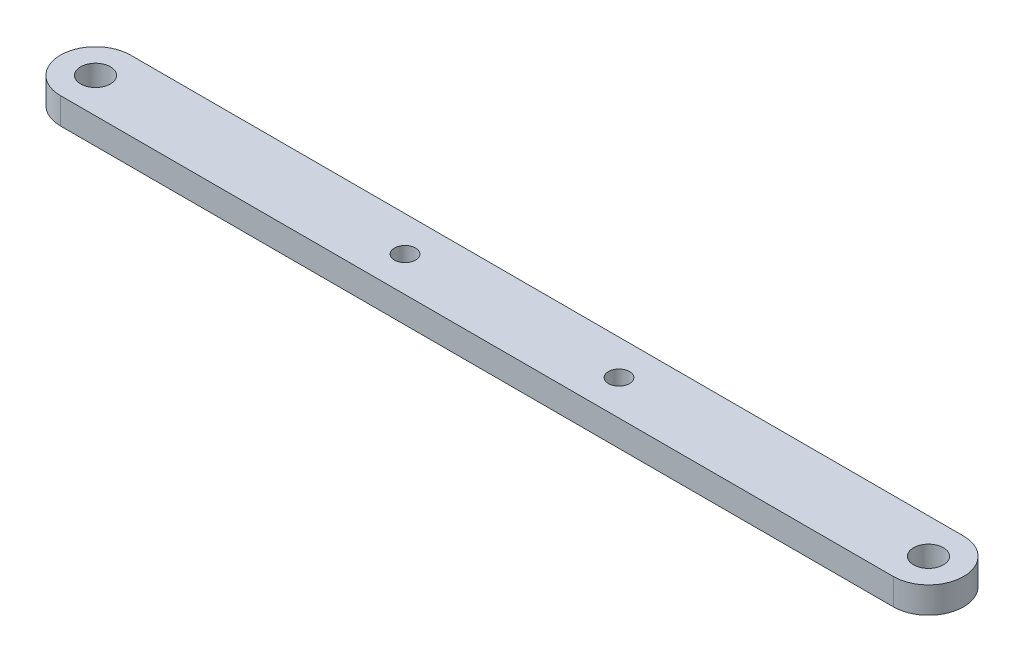
ISO-10303-21;
HEADER;
FILE_DESCRIPTION(('STEP AP214'),'2;1');
FILE_NAME('part.step','',(''),(''),'','','');
FILE_SCHEMA(('AUTOMOTIVE_DESIGN { 1 0 10303 214 1 1 1 1 }'));
ENDSEC;
DATA;
#1=APPLICATION_CONTEXT('core data for automotive mechanical design processes');
#2=APPLICATION_PROTOCOL_DEFINITION('international standard','automotive_design',2000,#1);
#3=PRODUCT_CONTEXT('',#1,'mechanical');
#4=PRODUCT('Part','Part','',(#3));
#5=PRODUCT_RELATED_PRODUCT_CATEGORY('part','',(#4));
#6=PRODUCT_DEFINITION_FORMATION('','',#4);
#7=PRODUCT_DEFINITION_CONTEXT('part definition',#1,'design');
#8=PRODUCT_DEFINITION('design','',#6,#7);
#9=PRODUCT_DEFINITION_SHAPE('','',#8);
#10=(LENGTH_UNIT() NAMED_UNIT(*) SI_UNIT(.MILLI.,.METRE.));
#11=(NAMED_UNIT(*) PLANE_ANGLE_UNIT() SI_UNIT($,.RADIAN.));
#12=(NAMED_UNIT(*) SI_UNIT($,.STERADIAN.) SOLID_ANGLE_UNIT());
#13=UNCERTAINTY_MEASURE_WITH_UNIT(LENGTH_MEASURE(1.E-05),#10,'distance_accuracy_value','');
#14=(GEOMETRIC_REPRESENTATION_CONTEXT(3) GLOBAL_UNCERTAINTY_ASSIGNED_CONTEXT((#13)) GLOBAL_UNIT_ASSIGNED_CONTEXT((#10,
#11,#12)) REPRESENTATION_CONTEXT('',''));
#15=CARTESIAN_POINT('',(0.,0.,0.));
#16=DIRECTION('',(0.,0.,1.));
#17=DIRECTION('',(1.,0.,0.));
#18=AXIS2_PLACEMENT_3D('',#15,#16,#17);
#19=CARTESIAN_POINT('',(0.,3.,0.));
#20=DIRECTION('',(0.,-1.,0.));
#21=DIRECTION('',(0.,0.,-1.));
#22=AXIS2_PLACEMENT_3D('',#19,#20,#21);
#23=CYLINDRICAL_SURFACE('',#22,4.);
#24=CARTESIAN_POINT('',(0.,0.,0.));
#25=DIRECTION('',(0.,1.,0.));
#26=DIRECTION('',(0.,0.,1.));
#27=AXIS2_PLACEMENT_3D('',#24,#25,#26);
#28=CIRCLE('',#27,4.);
#29=CARTESIAN_POINT('',(0.,0.,-4.));
#30=VERTEX_POINT('',#29);
#31=CARTESIAN_POINT('',(0.,0.,4.));
#32=VERTEX_POINT('',#31);
#33=EDGE_CURVE('E96',#30,#32,#28,.T.);
#34=ORIENTED_EDGE('',*,*,#33,.T.);
#35=DIRECTION('',(0.,-1.,0.));
#36=VECTOR('',#35,1.);
#37=CARTESIAN_POINT('',(0.,3.,4.));
#38=LINE('',#37,#36);
#39=CARTESIAN_POINT('',(0.,3.,4.));
#40=VERTEX_POINT('',#39);
#41=EDGE_CURVE('E11',#40,#32,#38,.T.);
#42=ORIENTED_EDGE('',*,*,#41,.F.);
#43=CARTESIAN_POINT('',(0.,3.,0.));
#44=DIRECTION('',(0.,1.,0.));
#45=DIRECTION('',(0.,0.,1.));
#46=AXIS2_PLACEMENT_3D('',#43,#44,#45);
#47=CIRCLE('',#46,4.);
#48=CARTESIAN_POINT('',(0.,3.,-4.));
#49=VERTEX_POINT('',#48);
#50=EDGE_CURVE('E84',#49,#40,#47,.T.);
#51=ORIENTED_EDGE('',*,*,#50,.F.);
#52=DIRECTION('',(0.,-1.,0.));
#53=VECTOR('',#52,1.);
#54=CARTESIAN_POINT('',(0.,3.,-4.));
#55=LINE('',#54,#53);
#56=EDGE_CURVE('E92',#49,#30,#55,.T.);
#57=ORIENTED_EDGE('',*,*,#56,.T.);
#58=EDGE_LOOP('',(#34,#42,#51,#57));
#59=FACE_BOUND('',#58,.T.);
#60=ADVANCED_FACE('F33',(#59),#23,.T.);
#61=CARTESIAN_POINT('',(0.,3.,4.));
#62=DIRECTION('',(0.,0.,-1.));
#63=DIRECTION('',(-1.,0.,0.));
#64=AXIS2_PLACEMENT_3D('',#61,#62,#63);
#65=PLANE('',#64);
#66=DIRECTION('',(1.,0.,0.));
#67=VECTOR('',#66,1.);
#68=CARTESIAN_POINT('',(0.,0.,4.));
#69=LINE('',#68,#67);
#70=CARTESIAN_POINT('',(95.,0.,4.));
#71=VERTEX_POINT('',#70);
#72=EDGE_CURVE('E88',#32,#71,#69,.T.);
#73=ORIENTED_EDGE('',*,*,#72,.T.);
#74=DIRECTION('',(0.,-1.,0.));
#75=VECTOR('',#74,1.);
#76=CARTESIAN_POINT('',(95.,3.,4.));
#77=LINE('',#76,#75);
#78=CARTESIAN_POINT('',(95.,3.,4.));
#79=VERTEX_POINT('',#78);
#80=EDGE_CURVE('E41',#79,#71,#77,.T.);
#81=ORIENTED_EDGE('',*,*,#80,.F.);
#82=DIRECTION('',(1.,0.,0.));
#83=VECTOR('',#82,1.);
#84=CARTESIAN_POINT('',(0.,3.,4.));
#85=LINE('',#84,#83);
#86=EDGE_CURVE('E79',#40,#79,#85,.T.);
#87=ORIENTED_EDGE('',*,*,#86,.F.);
#88=ORIENTED_EDGE('',*,*,#41,.T.);
#89=EDGE_LOOP('',(#73,#81,#87,#88));
#90=FACE_BOUND('',#89,.T.);
#91=ADVANCED_FACE('F87',(#90),#65,.F.);
#92=CARTESIAN_POINT('',(95.,3.,0.));
#93=DIRECTION('',(0.,-1.,0.));
#94=DIRECTION('',(0.,0.,-1.));
#95=AXIS2_PLACEMENT_3D('',#92,#93,#94);
#96=CYLINDRICAL_SURFACE('',#95,4.);
#97=CARTESIAN_POINT('',(95.,0.,0.));
#98=DIRECTION('',(0.,1.,0.));
#99=DIRECTION('',(0.,0.,1.));
#100=AXIS2_PLACEMENT_3D('',#97,#98,#99);
#101=CIRCLE('',#100,4.);
#102=CARTESIAN_POINT('',(95.,0.,-4.));
#103=VERTEX_POINT('',#102);
#104=EDGE_CURVE('E66',#71,#103,#101,.T.);
#105=ORIENTED_EDGE('',*,*,#104,.T.);
#106=DIRECTION('',(0.,-1.,0.));
#107=VECTOR('',#106,1.);
#108=CARTESIAN_POINT('',(95.,3.,-4.));
#109=LINE('',#108,#107);
#110=CARTESIAN_POINT('',(95.,3.,-4.));
#111=VERTEX_POINT('',#110);
#112=EDGE_CURVE('E89',#111,#103,#109,.T.);
#113=ORIENTED_EDGE('',*,*,#112,.F.);
#114=CARTESIAN_POINT('',(95.,3.,0.));
#115=DIRECTION('',(0.,1.,0.));
#116=DIRECTION('',(0.,0.,1.));
#117=AXIS2_PLACEMENT_3D('',#114,#115,#116);
#118=CIRCLE('',#117,4.);
#119=EDGE_CURVE('E82',#79,#111,#118,.T.);
#120=ORIENTED_EDGE('',*,*,#119,.F.);
#121=ORIENTED_EDGE('',*,*,#80,.T.);
#122=EDGE_LOOP('',(#105,#113,#120,#121));
#123=FACE_BOUND('',#122,.T.);
#124=ADVANCED_FACE('F90',(#123),#96,.T.);
#125=CARTESIAN_POINT('',(0.,3.,-4.));
#126=DIRECTION('',(0.,0.,1.));
#127=DIRECTION('',(1.,0.,0.));
#128=AXIS2_PLACEMENT_3D('',#125,#126,#127);
#129=PLANE('',#128);
#130=DIRECTION('',(-1.,0.,0.));
#131=VECTOR('',#130,1.);
#132=CARTESIAN_POINT('',(0.,0.,-4.));
#133=LINE('',#132,#131);
#134=EDGE_CURVE('E72',#103,#30,#133,.T.);
#135=ORIENTED_EDGE('',*,*,#134,.T.);
#136=ORIENTED_EDGE('',*,*,#56,.F.);
#137=DIRECTION('',(-1.,0.,0.));
#138=VECTOR('',#137,1.);
#139=CARTESIAN_POINT('',(0.,3.,-4.));
#140=LINE('',#139,#138);
#141=EDGE_CURVE('E49',#111,#49,#140,.T.);
#142=ORIENTED_EDGE('',*,*,#141,.F.);
#143=ORIENTED_EDGE('',*,*,#112,.T.);
#144=EDGE_LOOP('',(#135,#136,#142,#143));
#145=FACE_BOUND('',#144,.T.);
#146=ADVANCED_FACE('F104',(#145),#129,.F.);
#147=CARTESIAN_POINT('',(0.,3.,0.));
#148=DIRECTION('',(0.,1.,0.));
#149=DIRECTION('',(0.,0.,1.));
#150=AXIS2_PLACEMENT_3D('',#147,#148,#149);
#151=PLANE('',#150);
#152=CARTESIAN_POINT('',(59.7,3.,0.));
#153=DIRECTION('',(0.,1.,0.));
#154=DIRECTION('',(0.,0.,1.));
#155=AXIS2_PLACEMENT_3D('',#152,#153,#154);
#156=CIRCLE('',#155,1.19999999999999);
#157=CARTESIAN_POINT('',(59.7,3.,1.19999999999999));
#158=VERTEX_POINT('',#157);
#159=EDGE_CURVE('E130',#158,#158,#156,.T.);
#160=ORIENTED_EDGE('',*,*,#159,.F.);
#161=EDGE_LOOP('',(#160));
#162=FACE_BOUND('',#161,.T.);
#163=CARTESIAN_POINT('',(35.3,3.,0.));
#164=DIRECTION('',(0.,1.,0.));
#165=DIRECTION('',(0.,0.,1.));
#166=AXIS2_PLACEMENT_3D('',#163,#164,#165);
#167=CIRCLE('',#166,1.19999999999999);
#168=CARTESIAN_POINT('',(35.3,3.,1.19999999999999));
#169=VERTEX_POINT('',#168);
#170=EDGE_CURVE('E124',#169,#169,#167,.T.);
#171=ORIENTED_EDGE('',*,*,#170,.F.);
#172=EDGE_LOOP('',(#171));
#173=FACE_BOUND('',#172,.T.);
#174=CARTESIAN_POINT('',(95.,3.,0.));
#175=DIRECTION('',(0.,1.,0.));
#176=DIRECTION('',(0.,0.,1.));
#177=AXIS2_PLACEMENT_3D('',#174,#175,#176);
#178=CIRCLE('',#177,1.69999999999999);
#179=CARTESIAN_POINT('',(95.,3.,1.69999999999999));
#180=VERTEX_POINT('',#179);
#181=EDGE_CURVE('E118',#180,#180,#178,.T.);
#182=ORIENTED_EDGE('',*,*,#181,.F.);
#183=EDGE_LOOP('',(#182));
#184=FACE_BOUND('',#183,.T.);
#185=CARTESIAN_POINT('',(0.,3.,0.));
#186=DIRECTION('',(0.,1.,0.));
#187=DIRECTION('',(0.,0.,1.));
#188=AXIS2_PLACEMENT_3D('',#185,#186,#187);
#189=CIRCLE('',#188,1.69999999999999);
#190=CARTESIAN_POINT('',(0.,3.,1.69999999999999));
#191=VERTEX_POINT('',#190);
#192=EDGE_CURVE('E112',#191,#191,#189,.T.);
#193=ORIENTED_EDGE('',*,*,#192,.F.);
#194=EDGE_LOOP('',(#193));
#195=FACE_BOUND('',#194,.T.);
#196=ORIENTED_EDGE('',*,*,#50,.T.);
#197=ORIENTED_EDGE('',*,*,#86,.T.);
#198=ORIENTED_EDGE('',*,*,#119,.T.);
#199=ORIENTED_EDGE('',*,*,#141,.T.);
#200=EDGE_LOOP('',(#196,#197,#198,#199));
#201=FACE_BOUND('',#200,.T.);
#202=ADVANCED_FACE('F80',(#162,#173,#184,#195,#201),#151,.T.);
#203=CARTESIAN_POINT('',(0.,0.,0.));
#204=DIRECTION('',(0.,1.,0.));
#205=DIRECTION('',(0.,0.,1.));
#206=AXIS2_PLACEMENT_3D('',#203,#204,#205);
#207=PLANE('',#206);
#208=CARTESIAN_POINT('',(59.7,0.,0.));
#209=DIRECTION('',(0.,1.,0.));
#210=DIRECTION('',(0.,0.,1.));
#211=AXIS2_PLACEMENT_3D('',#208,#209,#210);
#212=CIRCLE('',#211,1.2);
#213=CARTESIAN_POINT('',(59.7,0.,1.2));
#214=VERTEX_POINT('',#213);
#215=EDGE_CURVE('E127',#214,#214,#212,.T.);
#216=ORIENTED_EDGE('',*,*,#215,.T.);
#217=EDGE_LOOP('',(#216));
#218=FACE_BOUND('',#217,.T.);
#219=CARTESIAN_POINT('',(35.3,0.,0.));
#220=DIRECTION('',(0.,1.,0.));
#221=DIRECTION('',(0.,0.,1.));
#222=AXIS2_PLACEMENT_3D('',#219,#220,#221);
#223=CIRCLE('',#222,1.2);
#224=CARTESIAN_POINT('',(35.3,0.,1.2));
#225=VERTEX_POINT('',#224);
#226=EDGE_CURVE('E121',#225,#225,#223,.T.);
#227=ORIENTED_EDGE('',*,*,#226,.T.);
#228=EDGE_LOOP('',(#227));
#229=FACE_BOUND('',#228,.T.);
#230=CARTESIAN_POINT('',(95.,0.,0.));
#231=DIRECTION('',(0.,1.,0.));
#232=DIRECTION('',(0.,0.,1.));
#233=AXIS2_PLACEMENT_3D('',#230,#231,#232);
#234=CIRCLE('',#233,1.69999999999999);
#235=CARTESIAN_POINT('',(95.,0.,1.69999999999999));
#236=VERTEX_POINT('',#235);
#237=EDGE_CURVE('E115',#236,#236,#234,.T.);
#238=ORIENTED_EDGE('',*,*,#237,.T.);
#239=EDGE_LOOP('',(#238));
#240=FACE_BOUND('',#239,.T.);
#241=CARTESIAN_POINT('',(0.,0.,0.));
#242=DIRECTION('',(0.,1.,0.));
#243=DIRECTION('',(0.,0.,1.));
#244=AXIS2_PLACEMENT_3D('',#241,#242,#243);
#245=CIRCLE('',#244,1.7);
#246=CARTESIAN_POINT('',(0.,0.,1.7));
#247=VERTEX_POINT('',#246);
#248=EDGE_CURVE('E99',#247,#247,#245,.T.);
#249=ORIENTED_EDGE('',*,*,#248,.T.);
#250=EDGE_LOOP('',(#249));
#251=FACE_BOUND('',#250,.T.);
#252=ORIENTED_EDGE('',*,*,#33,.F.);
#253=ORIENTED_EDGE('',*,*,#134,.F.);
#254=ORIENTED_EDGE('',*,*,#104,.F.);
#255=ORIENTED_EDGE('',*,*,#72,.F.);
#256=EDGE_LOOP('',(#252,#253,#254,#255));
#257=FACE_BOUND('',#256,.T.);
#258=ADVANCED_FACE('F107',(#218,#229,#240,#251,#257),#207,.F.);
#259=CARTESIAN_POINT('',(0.,3.,0.));
#260=DIRECTION('',(0.,1.,0.));
#261=DIRECTION('',(0.,0.,1.));
#262=AXIS2_PLACEMENT_3D('',#259,#260,#261);
#263=CYLINDRICAL_SURFACE('',#262,1.69999999999999);
#264=ORIENTED_EDGE('',*,*,#248,.F.);
#265=EDGE_LOOP('',(#264));
#266=FACE_BOUND('',#265,.T.);
#267=ORIENTED_EDGE('',*,*,#192,.T.);
#268=EDGE_LOOP('',(#267));
#269=FACE_BOUND('',#268,.T.);
#270=ADVANCED_FACE('F145',(#266,#269),#263,.F.);
#271=CARTESIAN_POINT('',(95.,3.,0.));
#272=DIRECTION('',(0.,1.,0.));
#273=DIRECTION('',(0.,0.,1.));
#274=AXIS2_PLACEMENT_3D('',#271,#272,#273);
#275=CYLINDRICAL_SURFACE('',#274,1.69999999999999);
#276=ORIENTED_EDGE('',*,*,#237,.F.);
#277=EDGE_LOOP('',(#276));
#278=FACE_BOUND('',#277,.T.);
#279=ORIENTED_EDGE('',*,*,#181,.T.);
#280=EDGE_LOOP('',(#279));
#281=FACE_BOUND('',#280,.T.);
#282=ADVANCED_FACE('F147',(#278,#281),#275,.F.);
#283=CARTESIAN_POINT('',(35.3,3.,0.));
#284=DIRECTION('',(0.,1.,0.));
#285=DIRECTION('',(0.,0.,1.));
#286=AXIS2_PLACEMENT_3D('',#283,#284,#285);
#287=CYLINDRICAL_SURFACE('',#286,1.19999999999999);
#288=ORIENTED_EDGE('',*,*,#226,.F.);
#289=EDGE_LOOP('',(#288));
#290=FACE_BOUND('',#289,.T.);
#291=ORIENTED_EDGE('',*,*,#170,.T.);
#292=EDGE_LOOP('',(#291));
#293=FACE_BOUND('',#292,.T.);
#294=ADVANCED_FACE('F154',(#290,#293),#287,.F.);
#295=CARTESIAN_POINT('',(59.7,3.,0.));
#296=DIRECTION('',(0.,1.,0.));
#297=DIRECTION('',(0.,0.,1.));
#298=AXIS2_PLACEMENT_3D('',#295,#296,#297);
#299=CYLINDRICAL_SURFACE('',#298,1.19999999999999);
#300=ORIENTED_EDGE('',*,*,#215,.F.);
#301=EDGE_LOOP('',(#300));
#302=FACE_BOUND('',#301,.T.);
#303=ORIENTED_EDGE('',*,*,#159,.T.);
#304=EDGE_LOOP('',(#303));
#305=FACE_BOUND('',#304,.T.);
#306=ADVANCED_FACE('F134',(#302,#305),#299,.F.);
#307=CLOSED_SHELL('',(#60,#91,#124,#146,#202,#258,#270,#282,#294,#306));
#308=MANIFOLD_SOLID_BREP('B2',#307);
#309=ADVANCED_BREP_SHAPE_REPRESENTATION('',(#18,#308),#14);
#310=SHAPE_DEFINITION_REPRESENTATION(#9,#309);
ENDSEC;
END-ISO-10303-21;
